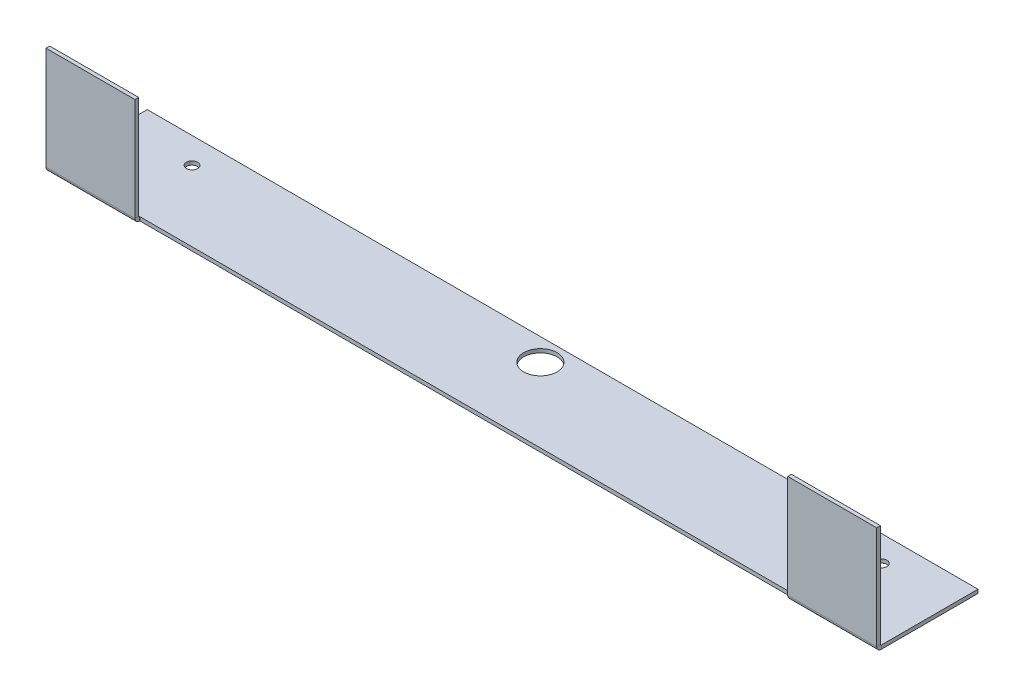
ISO-10303-21;
HEADER;
FILE_DESCRIPTION(('STEP AP214'),'2;1');
FILE_NAME('part.step','',(''),(''),'','','');
FILE_SCHEMA(('AUTOMOTIVE_DESIGN { 1 0 10303 214 1 1 1 1 }'));
ENDSEC;
DATA;
#1=APPLICATION_CONTEXT('core data for automotive mechanical design processes');
#2=APPLICATION_PROTOCOL_DEFINITION('international standard','automotive_design',2000,#1);
#3=PRODUCT_CONTEXT('',#1,'mechanical');
#4=PRODUCT('Part','Part','',(#3));
#5=PRODUCT_RELATED_PRODUCT_CATEGORY('part','',(#4));
#6=PRODUCT_DEFINITION_FORMATION('','',#4);
#7=PRODUCT_DEFINITION_CONTEXT('part definition',#1,'design');
#8=PRODUCT_DEFINITION('design','',#6,#7);
#9=PRODUCT_DEFINITION_SHAPE('','',#8);
#10=(LENGTH_UNIT() NAMED_UNIT(*) SI_UNIT(.MILLI.,.METRE.));
#11=(NAMED_UNIT(*) PLANE_ANGLE_UNIT() SI_UNIT($,.RADIAN.));
#12=(NAMED_UNIT(*) SI_UNIT($,.STERADIAN.) SOLID_ANGLE_UNIT());
#13=UNCERTAINTY_MEASURE_WITH_UNIT(LENGTH_MEASURE(1.E-05),#10,'distance_accuracy_value','');
#14=(GEOMETRIC_REPRESENTATION_CONTEXT(3) GLOBAL_UNCERTAINTY_ASSIGNED_CONTEXT((#13)) GLOBAL_UNIT_ASSIGNED_CONTEXT((#10,
#11,#12)) REPRESENTATION_CONTEXT('',''));
#15=CARTESIAN_POINT('',(0.,0.,0.));
#16=DIRECTION('',(0.,0.,1.));
#17=DIRECTION('',(1.,0.,0.));
#18=AXIS2_PLACEMENT_3D('',#15,#16,#17);
#19=CARTESIAN_POINT('',(-106.274614161748,-4.17251225689531,5.35248774310397));
#20=DIRECTION('',(0.,-1.,0.));
#21=DIRECTION('',(0.,0.,-1.));
#22=AXIS2_PLACEMENT_3D('',#19,#20,#21);
#23=PLANE('',#22);
#24=CARTESIAN_POINT('',(-45.7489541617481,-4.17251225689547,27.5774877431035));
#25=DIRECTION('',(0.,-1.,0.));
#26=DIRECTION('',(0.,0.,-1.));
#27=AXIS2_PLACEMENT_3D('',#24,#25,#26);
#28=CIRCLE('',#27,4.76250000000001);
#29=CARTESIAN_POINT('',(-45.7489541617481,-4.17251225689543,22.8149877431035));
#30=VERTEX_POINT('',#29);
#31=EDGE_CURVE('E222',#30,#30,#28,.T.);
#32=ORIENTED_EDGE('',*,*,#31,.F.);
#33=EDGE_LOOP('',(#32));
#34=FACE_BOUND('',#33,.T.);
#35=CARTESIAN_POINT('',(544.399725838252,-4.17251225689545,27.5774877431036));
#36=DIRECTION('',(0.,-1.,0.));
#37=DIRECTION('',(0.,0.,-1.));
#38=AXIS2_PLACEMENT_3D('',#35,#36,#37);
#39=CIRCLE('',#38,4.76250000000001);
#40=CARTESIAN_POINT('',(544.399725838252,-4.17251225689541,22.8149877431036));
#41=VERTEX_POINT('',#40);
#42=EDGE_CURVE('E212',#41,#41,#39,.T.);
#43=ORIENTED_EDGE('',*,*,#42,.F.);
#44=EDGE_LOOP('',(#43));
#45=FACE_BOUND('',#44,.T.);
#46=CARTESIAN_POINT('',(249.325385838252,-4.17251225689543,24.4024877431035));
#47=DIRECTION('',(0.,-1.,0.));
#48=DIRECTION('',(0.,0.,-1.));
#49=AXIS2_PLACEMENT_3D('',#46,#47,#48);
#50=CIRCLE('',#49,14.2875);
#51=CARTESIAN_POINT('',(249.325385838252,-4.17251225689534,10.1149877431035));
#52=VERTEX_POINT('',#51);
#53=EDGE_CURVE('E209',#52,#52,#50,.T.);
#54=ORIENTED_EDGE('',*,*,#53,.F.);
#55=EDGE_LOOP('',(#54));
#56=FACE_BOUND('',#55,.T.);
#57=DIRECTION('',(0.,0.,-1.));
#58=VECTOR('',#57,1.);
#59=CARTESIAN_POINT('',(-30.0746141617481,-4.17251225689654,179.977487743104));
#60=LINE('',#59,#58);
#61=CARTESIAN_POINT('',(-30.0746141617481,-4.17251225689589,88.1634));
#62=VERTEX_POINT('',#61);
#63=CARTESIAN_POINT('',(-30.0746141617481,-4.1725122568959,87.902487743104));
#64=VERTEX_POINT('',#63);
#65=EDGE_CURVE('E182',#62,#64,#60,.T.);
#66=ORIENTED_EDGE('',*,*,#65,.F.);
#67=DIRECTION('',(-1.,0.,0.));
#68=VECTOR('',#67,1.);
#69=CARTESIAN_POINT('',(-106.274614161748,-4.1725122568959,88.1634));
#70=LINE('',#69,#68);
#71=CARTESIAN_POINT('',(-106.274614161748,-4.1725122568959,88.1634));
#72=VERTEX_POINT('',#71);
#73=EDGE_CURVE('E162',#62,#72,#70,.T.);
#74=ORIENTED_EDGE('',*,*,#73,.T.);
#75=DIRECTION('',(0.,0.,1.));
#76=VECTOR('',#75,1.);
#77=CARTESIAN_POINT('',(-106.274614161748,-4.17251225689531,5.35248774310397));
#78=LINE('',#77,#76);
#79=CARTESIAN_POINT('',(-106.274614161748,-4.17251225689531,5.35248774310397));
#80=VERTEX_POINT('',#79);
#81=EDGE_CURVE('E197',#80,#72,#78,.T.);
#82=ORIENTED_EDGE('',*,*,#81,.F.);
#83=DIRECTION('',(1.,0.,0.));
#84=VECTOR('',#83,1.);
#85=CARTESIAN_POINT('',(-106.274614161748,-4.17251225689531,5.35248774310397));
#86=LINE('',#85,#84);
#87=CARTESIAN_POINT('',(604.925385838252,-4.1725122568953,5.35248774310396));
#88=VERTEX_POINT('',#87);
#89=EDGE_CURVE('E314',#80,#88,#86,.T.);
#90=ORIENTED_EDGE('',*,*,#89,.T.);
#91=DIRECTION('',(0.,0.,1.));
#92=VECTOR('',#91,1.);
#93=CARTESIAN_POINT('',(604.925385838252,-4.1725122568953,5.35248774310396));
#94=LINE('',#93,#92);
#95=CARTESIAN_POINT('',(604.925385838252,-4.17251225689588,88.1633999999999));
#96=VERTEX_POINT('',#95);
#97=EDGE_CURVE('E199',#88,#96,#94,.T.);
#98=ORIENTED_EDGE('',*,*,#97,.T.);
#99=DIRECTION('',(1.,0.,0.));
#100=VECTOR('',#99,1.);
#101=CARTESIAN_POINT('',(-106.274614161748,-4.1725122568959,88.1633999999999));
#102=LINE('',#101,#100);
#103=CARTESIAN_POINT('',(528.725385838252,-4.17251225689588,88.1633999999999));
#104=VERTEX_POINT('',#103);
#105=EDGE_CURVE('E319',#104,#96,#102,.T.);
#106=ORIENTED_EDGE('',*,*,#105,.F.);
#107=DIRECTION('',(0.,0.,1.));
#108=VECTOR('',#107,1.);
#109=CARTESIAN_POINT('',(528.725385838252,-4.17251225689652,179.977487743104));
#110=LINE('',#109,#108);
#111=CARTESIAN_POINT('',(528.725385838252,-4.17251225689588,87.9024877431039));
#112=VERTEX_POINT('',#111);
#113=EDGE_CURVE('E309',#112,#104,#110,.T.);
#114=ORIENTED_EDGE('',*,*,#113,.F.);
#115=DIRECTION('',(-1.,0.,0.));
#116=VECTOR('',#115,1.);
#117=CARTESIAN_POINT('',(528.725385838252,-4.17251225689588,87.9024877431039));
#118=LINE('',#117,#116);
#119=EDGE_CURVE('E184',#112,#64,#118,.T.);
#120=ORIENTED_EDGE('',*,*,#119,.T.);
#121=EDGE_LOOP('',(#66,#74,#82,#90,#98,#106,#114,#120));
#122=FACE_BOUND('',#121,.T.);
#123=ADVANCED_FACE('F47',(#34,#45,#56,#122),#23,.T.);
#124=CARTESIAN_POINT('',(-106.274614161748,-0.997512256895317,5.35248774310398));
#125=DIRECTION('',(-1.,0.,0.));
#126=DIRECTION('',(0.,0.,-1.));
#127=AXIS2_PLACEMENT_3D('',#124,#125,#126);
#128=PLANE('',#127);
#129=ORIENTED_EDGE('',*,*,#81,.T.);
#130=DIRECTION('',(0.,1.,0.));
#131=VECTOR('',#130,1.);
#132=CARTESIAN_POINT('',(-106.274614161748,-0.997512256895608,88.1634));
#133=LINE('',#132,#131);
#134=CARTESIAN_POINT('',(-106.274614161748,-0.997512256895895,88.1634));
#135=VERTEX_POINT('',#134);
#136=EDGE_CURVE('E12',#72,#135,#133,.T.);
#137=ORIENTED_EDGE('',*,*,#136,.T.);
#138=DIRECTION('',(0.,0.,1.));
#139=VECTOR('',#138,1.);
#140=CARTESIAN_POINT('',(-106.274614161748,-0.997512256895317,5.35248774310398));
#141=LINE('',#140,#139);
#142=CARTESIAN_POINT('',(-106.274614161748,-0.997512256895317,5.35248774310398));
#143=VERTEX_POINT('',#142);
#144=EDGE_CURVE('E200',#143,#135,#141,.T.);
#145=ORIENTED_EDGE('',*,*,#144,.F.);
#146=DIRECTION('',(0.,-1.,0.));
#147=VECTOR('',#146,1.);
#148=CARTESIAN_POINT('',(-106.274614161748,-0.997512256895317,5.35248774310398));
#149=LINE('',#148,#147);
#150=EDGE_CURVE('E203',#143,#80,#149,.T.);
#151=ORIENTED_EDGE('',*,*,#150,.T.);
#152=EDGE_LOOP('',(#129,#137,#145,#151));
#153=FACE_BOUND('',#152,.T.);
#154=ADVANCED_FACE('F49',(#153),#128,.T.);
#155=CARTESIAN_POINT('',(-106.274614161748,-0.997512256895317,5.35248774310398));
#156=DIRECTION('',(0.,-1.,0.));
#157=DIRECTION('',(0.,0.,-1.));
#158=AXIS2_PLACEMENT_3D('',#155,#156,#157);
#159=PLANE('',#158);
#160=CARTESIAN_POINT('',(-45.7489541617481,-0.997512256895469,27.5774877431035));
#161=DIRECTION('',(0.,-1.,0.));
#162=DIRECTION('',(0.,0.,-1.));
#163=AXIS2_PLACEMENT_3D('',#160,#161,#162);
#164=CIRCLE('',#163,4.76250000000001);
#165=CARTESIAN_POINT('',(-45.7489541617481,-0.997512256895436,22.8149877431035));
#166=VERTEX_POINT('',#165);
#167=EDGE_CURVE('E51',#166,#166,#164,.T.);
#168=ORIENTED_EDGE('',*,*,#167,.T.);
#169=EDGE_LOOP('',(#168));
#170=FACE_BOUND('',#169,.T.);
#171=CARTESIAN_POINT('',(544.399725838252,-0.997512256895441,27.5774877431036));
#172=DIRECTION('',(0.,-1.,0.));
#173=DIRECTION('',(0.,0.,-1.));
#174=AXIS2_PLACEMENT_3D('',#171,#172,#173);
#175=CIRCLE('',#174,4.76250000000001);
#176=CARTESIAN_POINT('',(544.399725838252,-0.997512256895408,22.8149877431036));
#177=VERTEX_POINT('',#176);
#178=EDGE_CURVE('E210',#177,#177,#175,.T.);
#179=ORIENTED_EDGE('',*,*,#178,.T.);
#180=EDGE_LOOP('',(#179));
#181=FACE_BOUND('',#180,.T.);
#182=CARTESIAN_POINT('',(249.325385838252,-0.997512256895441,24.4024877431035));
#183=DIRECTION('',(0.,-1.,0.));
#184=DIRECTION('',(0.,0.,-1.));
#185=AXIS2_PLACEMENT_3D('',#182,#183,#184);
#186=CIRCLE('',#185,14.2875);
#187=CARTESIAN_POINT('',(249.325385838252,-0.997512256895342,10.1149877431035));
#188=VERTEX_POINT('',#187);
#189=EDGE_CURVE('E206',#188,#188,#186,.T.);
#190=ORIENTED_EDGE('',*,*,#189,.T.);
#191=EDGE_LOOP('',(#190));
#192=FACE_BOUND('',#191,.T.);
#193=DIRECTION('',(-1.,0.,0.));
#194=VECTOR('',#193,1.);
#195=CARTESIAN_POINT('',(-106.274614161748,-0.997512256895899,88.1634));
#196=LINE('',#195,#194);
#197=CARTESIAN_POINT('',(-30.0746141617481,-0.997512256895893,88.1634));
#198=VERTEX_POINT('',#197);
#199=EDGE_CURVE('E56',#198,#135,#196,.T.);
#200=ORIENTED_EDGE('',*,*,#199,.F.);
#201=DIRECTION('',(0.,0.,-1.));
#202=VECTOR('',#201,1.);
#203=CARTESIAN_POINT('',(-30.0746141617481,-0.997512256896538,179.977487743104));
#204=LINE('',#203,#202);
#205=CARTESIAN_POINT('',(-30.0746141617481,-0.997512256895899,87.9024877431041));
#206=VERTEX_POINT('',#205);
#207=EDGE_CURVE('E188',#198,#206,#204,.T.);
#208=ORIENTED_EDGE('',*,*,#207,.T.);
#209=DIRECTION('',(1.,0.,0.));
#210=VECTOR('',#209,1.);
#211=CARTESIAN_POINT('',(-106.274614161748,-0.997512256895899,87.902487743104));
#212=LINE('',#211,#210);
#213=CARTESIAN_POINT('',(528.725385838252,-0.997512256895886,87.902487743104));
#214=VERTEX_POINT('',#213);
#215=EDGE_CURVE('E300',#214,#206,#212,.F.);
#216=ORIENTED_EDGE('',*,*,#215,.F.);
#217=DIRECTION('',(0.,0.,1.));
#218=VECTOR('',#217,1.);
#219=CARTESIAN_POINT('',(528.725385838252,-0.997512256896524,179.977487743104));
#220=LINE('',#219,#218);
#221=CARTESIAN_POINT('',(528.725385838252,-0.997512256895886,88.1633999999999));
#222=VERTEX_POINT('',#221);
#223=EDGE_CURVE('E72',#214,#222,#220,.T.);
#224=ORIENTED_EDGE('',*,*,#223,.T.);
#225=DIRECTION('',(1.,0.,0.));
#226=VECTOR('',#225,1.);
#227=CARTESIAN_POINT('',(-106.274614161748,-0.997512256895899,88.1634));
#228=LINE('',#227,#226);
#229=CARTESIAN_POINT('',(604.925385838252,-0.997512256895886,88.1633999999999));
#230=VERTEX_POINT('',#229);
#231=EDGE_CURVE('E326',#222,#230,#228,.T.);
#232=ORIENTED_EDGE('',*,*,#231,.T.);
#233=DIRECTION('',(0.,0.,1.));
#234=VECTOR('',#233,1.);
#235=CARTESIAN_POINT('',(604.925385838252,-0.997512256895303,5.35248774310397));
#236=LINE('',#235,#234);
#237=CARTESIAN_POINT('',(604.925385838252,-0.997512256895303,5.35248774310397));
#238=VERTEX_POINT('',#237);
#239=EDGE_CURVE('E323',#238,#230,#236,.T.);
#240=ORIENTED_EDGE('',*,*,#239,.F.);
#241=DIRECTION('',(1.,0.,0.));
#242=VECTOR('',#241,1.);
#243=CARTESIAN_POINT('',(-106.274614161748,-0.997512256895317,5.35248774310398));
#244=LINE('',#243,#242);
#245=EDGE_CURVE('E204',#143,#238,#244,.T.);
#246=ORIENTED_EDGE('',*,*,#245,.F.);
#247=ORIENTED_EDGE('',*,*,#144,.T.);
#248=EDGE_LOOP('',(#200,#208,#216,#224,#232,#240,#246,#247));
#249=FACE_BOUND('',#248,.T.);
#250=ADVANCED_FACE('F369',(#170,#181,#192,#249),#159,.F.);
#251=CARTESIAN_POINT('',(528.725385838252,-0.997512256896524,179.977487743104));
#252=DIRECTION('',(1.,0.,0.));
#253=DIRECTION('',(0.,0.,1.));
#254=AXIS2_PLACEMENT_3D('',#251,#252,#253);
#255=PLANE('',#254);
#256=ORIENTED_EDGE('',*,*,#113,.T.);
#257=DIRECTION('',(0.,1.,0.));
#258=VECTOR('',#257,1.);
#259=CARTESIAN_POINT('',(528.725385838252,-0.997512256895872,88.1633999999999));
#260=LINE('',#259,#258);
#261=EDGE_CURVE('E171',#104,#222,#260,.T.);
#262=ORIENTED_EDGE('',*,*,#261,.T.);
#263=ORIENTED_EDGE('',*,*,#223,.F.);
#264=DIRECTION('',(0.,-1.,0.));
#265=VECTOR('',#264,1.);
#266=CARTESIAN_POINT('',(528.725385838252,-4.17251225689588,87.9024877431039));
#267=LINE('',#266,#265);
#268=EDGE_CURVE('E303',#112,#214,#267,.F.);
#269=ORIENTED_EDGE('',*,*,#268,.F.);
#270=EDGE_LOOP('',(#256,#262,#263,#269));
#271=FACE_BOUND('',#270,.T.);
#272=ADVANCED_FACE('F421',(#271),#255,.F.);
#273=CARTESIAN_POINT('',(604.925385838252,-4.1725122568953,5.35248774310396));
#274=DIRECTION('',(1.,0.,0.));
#275=DIRECTION('',(0.,0.,1.));
#276=AXIS2_PLACEMENT_3D('',#273,#274,#275);
#277=PLANE('',#276);
#278=DIRECTION('',(0.,1.,0.));
#279=VECTOR('',#278,1.);
#280=CARTESIAN_POINT('',(604.925385838252,-4.17251225689588,88.1633999999999));
#281=LINE('',#280,#279);
#282=EDGE_CURVE('E322',#96,#230,#281,.T.);
#283=ORIENTED_EDGE('',*,*,#282,.F.);
#284=ORIENTED_EDGE('',*,*,#97,.F.);
#285=DIRECTION('',(0.,1.,0.));
#286=VECTOR('',#285,1.);
#287=CARTESIAN_POINT('',(604.925385838252,-4.1725122568953,5.35248774310396));
#288=LINE('',#287,#286);
#289=EDGE_CURVE('E311',#88,#238,#288,.T.);
#290=ORIENTED_EDGE('',*,*,#289,.T.);
#291=ORIENTED_EDGE('',*,*,#239,.T.);
#292=EDGE_LOOP('',(#283,#284,#290,#291));
#293=FACE_BOUND('',#292,.T.);
#294=ADVANCED_FACE('F372',(#293),#277,.T.);
#295=CARTESIAN_POINT('',(0.,-4.17251225689531,5.35248774310397));
#296=DIRECTION('',(0.,0.,1.));
#297=DIRECTION('',(-1.,0.,0.));
#298=AXIS2_PLACEMENT_3D('',#295,#296,#297);
#299=PLANE('',#298);
#300=ORIENTED_EDGE('',*,*,#245,.T.);
#301=ORIENTED_EDGE('',*,*,#289,.F.);
#302=ORIENTED_EDGE('',*,*,#89,.F.);
#303=ORIENTED_EDGE('',*,*,#150,.F.);
#304=EDGE_LOOP('',(#300,#301,#302,#303));
#305=FACE_BOUND('',#304,.T.);
#306=ADVANCED_FACE('F374',(#305),#299,.F.);
#307=CARTESIAN_POINT('',(-30.0746141617481,-0.997512256896538,179.977487743104));
#308=DIRECTION('',(-1.,0.,0.));
#309=DIRECTION('',(0.,0.,-1.));
#310=AXIS2_PLACEMENT_3D('',#307,#308,#309);
#311=PLANE('',#310);
#312=DIRECTION('',(0.,1.,0.));
#313=VECTOR('',#312,1.);
#314=CARTESIAN_POINT('',(-30.0746141617481,-0.997512256896219,88.1634));
#315=LINE('',#314,#313);
#316=EDGE_CURVE('E170',#62,#198,#315,.T.);
#317=ORIENTED_EDGE('',*,*,#316,.F.);
#318=ORIENTED_EDGE('',*,*,#65,.T.);
#319=DIRECTION('',(0.,-1.,0.));
#320=VECTOR('',#319,1.);
#321=CARTESIAN_POINT('',(-30.0746141617481,-4.1725122568959,87.902487743104));
#322=LINE('',#321,#320);
#323=EDGE_CURVE('E307',#64,#206,#322,.F.);
#324=ORIENTED_EDGE('',*,*,#323,.T.);
#325=ORIENTED_EDGE('',*,*,#207,.F.);
#326=EDGE_LOOP('',(#317,#318,#324,#325));
#327=FACE_BOUND('',#326,.T.);
#328=ADVANCED_FACE('F191',(#327),#311,.F.);
#329=CARTESIAN_POINT('',(528.725385838252,-4.17251225689588,87.9024877431039));
#330=DIRECTION('',(0.,0.,1.));
#331=DIRECTION('',(-1.,0.,0.));
#332=AXIS2_PLACEMENT_3D('',#329,#330,#331);
#333=PLANE('',#332);
#334=ORIENTED_EDGE('',*,*,#323,.F.);
#335=ORIENTED_EDGE('',*,*,#119,.F.);
#336=ORIENTED_EDGE('',*,*,#268,.T.);
#337=ORIENTED_EDGE('',*,*,#215,.T.);
#338=EDGE_LOOP('',(#334,#335,#336,#337));
#339=FACE_BOUND('',#338,.T.);
#340=ADVANCED_FACE('F424',(#339),#333,.T.);
#341=CARTESIAN_POINT('',(0.,87.9024877431041,92.0750000000003));
#342=DIRECTION('',(0.,1.,0.));
#343=DIRECTION('',(-1.,0.,0.));
#344=AXIS2_PLACEMENT_3D('',#341,#342,#343);
#345=PLANE('',#344);
#346=DIRECTION('',(0.,0.,1.));
#347=VECTOR('',#346,1.);
#348=CARTESIAN_POINT('',(528.725385838252,87.9024877431041,88.9000000000003));
#349=LINE('',#348,#347);
#350=CARTESIAN_POINT('',(528.725385838252,87.9024877431041,88.9000000000003));
#351=VERTEX_POINT('',#350);
#352=CARTESIAN_POINT('',(528.725385838252,87.9024877431041,92.0750000000003));
#353=VERTEX_POINT('',#352);
#354=EDGE_CURVE('E294',#351,#353,#349,.T.);
#355=ORIENTED_EDGE('',*,*,#354,.T.);
#356=DIRECTION('',(1.,0.,0.));
#357=VECTOR('',#356,1.);
#358=CARTESIAN_POINT('',(-106.274614161748,87.9024877431041,92.0750000000003));
#359=LINE('',#358,#357);
#360=CARTESIAN_POINT('',(604.925385838252,87.9024877431041,92.0750000000003));
#361=VERTEX_POINT('',#360);
#362=EDGE_CURVE('E291',#353,#361,#359,.T.);
#363=ORIENTED_EDGE('',*,*,#362,.T.);
#364=DIRECTION('',(0.,0.,-1.));
#365=VECTOR('',#364,1.);
#366=CARTESIAN_POINT('',(604.925385838252,87.9024877431041,92.0750000000003));
#367=LINE('',#366,#365);
#368=CARTESIAN_POINT('',(604.925385838252,87.9024877431041,88.9000000000002));
#369=VERTEX_POINT('',#368);
#370=EDGE_CURVE('E288',#361,#369,#367,.T.);
#371=ORIENTED_EDGE('',*,*,#370,.T.);
#372=DIRECTION('',(1.,0.,0.));
#373=VECTOR('',#372,1.);
#374=CARTESIAN_POINT('',(-106.274614161748,87.9024877431041,88.9000000000003));
#375=LINE('',#374,#373);
#376=EDGE_CURVE('E273',#351,#369,#375,.T.);
#377=ORIENTED_EDGE('',*,*,#376,.F.);
#378=EDGE_LOOP('',(#355,#363,#371,#377));
#379=FACE_BOUND('',#378,.T.);
#380=ADVANCED_FACE('F353',(#379),#345,.T.);
#381=CARTESIAN_POINT('',(-106.274614161748,-86.7225122568959,92.0749999999997));
#382=DIRECTION('',(0.,0.,1.));
#383=DIRECTION('',(0.,-1.,0.));
#384=AXIS2_PLACEMENT_3D('',#381,#382,#383);
#385=PLANE('',#384);
#386=DIRECTION('',(0.,1.,0.));
#387=VECTOR('',#386,1.);
#388=CARTESIAN_POINT('',(528.725385838252,87.9024877431041,92.0750000000003));
#389=LINE('',#388,#387);
#390=CARTESIAN_POINT('',(528.725385838252,-0.260912256895895,92.0749999999999));
#391=VERTEX_POINT('',#390);
#392=EDGE_CURVE('E271',#391,#353,#389,.T.);
#393=ORIENTED_EDGE('',*,*,#392,.F.);
#394=DIRECTION('',(1.,0.,0.));
#395=VECTOR('',#394,1.);
#396=CARTESIAN_POINT('',(-106.274614161748,-0.260912256895909,92.075));
#397=LINE('',#396,#395);
#398=CARTESIAN_POINT('',(604.925385838252,-0.260912256895895,92.0749999999999));
#399=VERTEX_POINT('',#398);
#400=EDGE_CURVE('E285',#391,#399,#397,.T.);
#401=ORIENTED_EDGE('',*,*,#400,.T.);
#402=DIRECTION('',(0.,1.,0.));
#403=VECTOR('',#402,1.);
#404=CARTESIAN_POINT('',(604.925385838252,-86.7225122568959,92.0749999999996));
#405=LINE('',#404,#403);
#406=EDGE_CURVE('E283',#399,#361,#405,.T.);
#407=ORIENTED_EDGE('',*,*,#406,.T.);
#408=ORIENTED_EDGE('',*,*,#362,.F.);
#409=EDGE_LOOP('',(#393,#401,#407,#408));
#410=FACE_BOUND('',#409,.T.);
#411=ADVANCED_FACE('F351',(#410),#385,.T.);
#412=CARTESIAN_POINT('',(604.925385838252,-86.7225122568959,92.0749999999996));
#413=DIRECTION('',(1.,0.,0.));
#414=DIRECTION('',(0.,1.,0.));
#415=AXIS2_PLACEMENT_3D('',#412,#413,#414);
#416=PLANE('',#415);
#417=ORIENTED_EDGE('',*,*,#406,.F.);
#418=DIRECTION('',(0.,0.,-1.));
#419=VECTOR('',#418,1.);
#420=CARTESIAN_POINT('',(604.925385838252,-0.260912256895895,92.0749999999999));
#421=LINE('',#420,#419);
#422=CARTESIAN_POINT('',(604.925385838252,-0.260912256895882,88.8999999999999));
#423=VERTEX_POINT('',#422);
#424=EDGE_CURVE('E280',#399,#423,#421,.T.);
#425=ORIENTED_EDGE('',*,*,#424,.T.);
#426=DIRECTION('',(0.,1.,0.));
#427=VECTOR('',#426,1.);
#428=CARTESIAN_POINT('',(604.925385838252,-86.7225122568959,88.8999999999996));
#429=LINE('',#428,#427);
#430=EDGE_CURVE('E278',#423,#369,#429,.T.);
#431=ORIENTED_EDGE('',*,*,#430,.T.);
#432=ORIENTED_EDGE('',*,*,#370,.F.);
#433=EDGE_LOOP('',(#417,#425,#431,#432));
#434=FACE_BOUND('',#433,.T.);
#435=ADVANCED_FACE('F346',(#434),#416,.T.);
#436=CARTESIAN_POINT('',(-106.274614161748,-86.7225122568959,88.8999999999997));
#437=DIRECTION('',(0.,0.,1.));
#438=DIRECTION('',(0.,-1.,0.));
#439=AXIS2_PLACEMENT_3D('',#436,#437,#438);
#440=PLANE('',#439);
#441=DIRECTION('',(1.,0.,0.));
#442=VECTOR('',#441,1.);
#443=CARTESIAN_POINT('',(-106.274614161748,-0.260912256895895,88.9));
#444=LINE('',#443,#442);
#445=CARTESIAN_POINT('',(528.725385838252,-0.260912256895882,88.8999999999999));
#446=VERTEX_POINT('',#445);
#447=EDGE_CURVE('E297',#446,#423,#444,.T.);
#448=ORIENTED_EDGE('',*,*,#447,.F.);
#449=DIRECTION('',(0.,1.,0.));
#450=VECTOR('',#449,1.);
#451=CARTESIAN_POINT('',(528.725385838252,87.9024877431041,88.9000000000003));
#452=LINE('',#451,#450);
#453=EDGE_CURVE('E276',#446,#351,#452,.T.);
#454=ORIENTED_EDGE('',*,*,#453,.T.);
#455=ORIENTED_EDGE('',*,*,#376,.T.);
#456=ORIENTED_EDGE('',*,*,#430,.F.);
#457=EDGE_LOOP('',(#448,#454,#455,#456));
#458=FACE_BOUND('',#457,.T.);
#459=ADVANCED_FACE('F613',(#458),#440,.F.);
#460=CARTESIAN_POINT('',(528.725385838252,87.9024877431041,88.9000000000003));
#461=DIRECTION('',(1.,0.,0.));
#462=DIRECTION('',(0.,1.,0.));
#463=AXIS2_PLACEMENT_3D('',#460,#461,#462);
#464=PLANE('',#463);
#465=DIRECTION('',(0.,0.,-1.));
#466=VECTOR('',#465,1.);
#467=CARTESIAN_POINT('',(528.725385838252,-0.260912256895882,88.8999999999999));
#468=LINE('',#467,#466);
#469=EDGE_CURVE('E266',#391,#446,#468,.T.);
#470=ORIENTED_EDGE('',*,*,#469,.F.);
#471=ORIENTED_EDGE('',*,*,#392,.T.);
#472=ORIENTED_EDGE('',*,*,#354,.F.);
#473=ORIENTED_EDGE('',*,*,#453,.F.);
#474=EDGE_LOOP('',(#470,#471,#472,#473));
#475=FACE_BOUND('',#474,.T.);
#476=ADVANCED_FACE('F359',(#475),#464,.F.);
#477=CARTESIAN_POINT('',(528.725385838252,-0.260912256895882,88.1634));
#478=DIRECTION('',(-1.,0.,0.));
#479=DIRECTION('',(0.,-1.,0.));
#480=AXIS2_PLACEMENT_3D('',#477,#478,#479);
#481=PLANE('',#480);
#482=ORIENTED_EDGE('',*,*,#469,.T.);
#483=CARTESIAN_POINT('',(528.725385838252,-0.260912256895882,88.1634));
#484=DIRECTION('',(1.,0.,0.));
#485=DIRECTION('',(0.,1.,0.));
#486=AXIS2_PLACEMENT_3D('',#483,#484,#485);
#487=CIRCLE('',#486,0.7366);
#488=EDGE_CURVE('E232',#446,#222,#487,.T.);
#489=ORIENTED_EDGE('',*,*,#488,.T.);
#490=ORIENTED_EDGE('',*,*,#261,.F.);
#491=CARTESIAN_POINT('',(528.725385838252,-0.260912256895882,88.1634));
#492=DIRECTION('',(1.,0.,0.));
#493=DIRECTION('',(0.,-1.,0.));
#494=AXIS2_PLACEMENT_3D('',#491,#492,#493);
#495=CIRCLE('',#494,3.9116);
#496=EDGE_CURVE('E259',#391,#104,#495,.T.);
#497=ORIENTED_EDGE('',*,*,#496,.F.);
#498=EDGE_LOOP('',(#482,#489,#490,#497));
#499=FACE_BOUND('',#498,.T.);
#500=ADVANCED_FACE('F363',(#499),#481,.T.);
#501=CARTESIAN_POINT('',(604.925385838252,-0.260912256895882,88.1633999999999));
#502=DIRECTION('',(1.,0.,0.));
#503=DIRECTION('',(0.,1.,0.));
#504=AXIS2_PLACEMENT_3D('',#501,#502,#503);
#505=PLANE('',#504);
#506=ORIENTED_EDGE('',*,*,#282,.T.);
#507=CARTESIAN_POINT('',(604.925385838252,-0.260912256895882,88.1633999999999));
#508=DIRECTION('',(1.,0.,0.));
#509=DIRECTION('',(0.,1.,0.));
#510=AXIS2_PLACEMENT_3D('',#507,#508,#509);
#511=CIRCLE('',#510,0.7366);
#512=EDGE_CURVE('E263',#230,#423,#511,.F.);
#513=ORIENTED_EDGE('',*,*,#512,.T.);
#514=ORIENTED_EDGE('',*,*,#424,.F.);
#515=CARTESIAN_POINT('',(604.925385838252,-0.260912256895882,88.1633999999999));
#516=DIRECTION('',(-1.,0.,0.));
#517=DIRECTION('',(0.,-1.,0.));
#518=AXIS2_PLACEMENT_3D('',#515,#516,#517);
#519=CIRCLE('',#518,3.9116);
#520=EDGE_CURVE('E262',#96,#399,#519,.T.);
#521=ORIENTED_EDGE('',*,*,#520,.F.);
#522=EDGE_LOOP('',(#506,#513,#514,#521));
#523=FACE_BOUND('',#522,.T.);
#524=ADVANCED_FACE('F341',(#523),#505,.T.);
#525=CARTESIAN_POINT('',(490.471943571399,-0.260912256895882,88.1634));
#526=DIRECTION('',(1.,0.,0.));
#527=DIRECTION('',(0.,1.,0.));
#528=AXIS2_PLACEMENT_3D('',#525,#526,#527);
#529=CYLINDRICAL_SURFACE('',#528,3.9116);
#530=ORIENTED_EDGE('',*,*,#520,.T.);
#531=ORIENTED_EDGE('',*,*,#400,.F.);
#532=ORIENTED_EDGE('',*,*,#496,.T.);
#533=ORIENTED_EDGE('',*,*,#105,.T.);
#534=EDGE_LOOP('',(#530,#531,#532,#533));
#535=FACE_BOUND('',#534,.T.);
#536=ADVANCED_FACE('F338',(#535),#529,.T.);
#537=CARTESIAN_POINT('',(490.471943571399,-0.260912256895882,88.1634));
#538=DIRECTION('',(1.,0.,0.));
#539=DIRECTION('',(0.,1.,0.));
#540=AXIS2_PLACEMENT_3D('',#537,#538,#539);
#541=CYLINDRICAL_SURFACE('',#540,0.7366);
#542=ORIENTED_EDGE('',*,*,#512,.F.);
#543=ORIENTED_EDGE('',*,*,#231,.F.);
#544=ORIENTED_EDGE('',*,*,#488,.F.);
#545=ORIENTED_EDGE('',*,*,#447,.T.);
#546=EDGE_LOOP('',(#542,#543,#544,#545));
#547=FACE_BOUND('',#546,.T.);
#548=ADVANCED_FACE('F367',(#547),#541,.F.);
#549=CARTESIAN_POINT('',(0.,87.902487743104,92.0750000000003));
#550=DIRECTION('',(0.,1.,0.));
#551=DIRECTION('',(-1.,0.,0.));
#552=AXIS2_PLACEMENT_3D('',#549,#550,#551);
#553=PLANE('',#552);
#554=DIRECTION('',(0.,0.,1.));
#555=VECTOR('',#554,1.);
#556=CARTESIAN_POINT('',(-30.0746141617481,87.902487743104,88.9000000000003));
#557=LINE('',#556,#555);
#558=CARTESIAN_POINT('',(-30.0746141617481,87.902487743104,88.9000000000003));
#559=VERTEX_POINT('',#558);
#560=CARTESIAN_POINT('',(-30.0746141617481,87.902487743104,92.0750000000003));
#561=VERTEX_POINT('',#560);
#562=EDGE_CURVE('E244',#559,#561,#557,.T.);
#563=ORIENTED_EDGE('',*,*,#562,.F.);
#564=DIRECTION('',(1.,0.,0.));
#565=VECTOR('',#564,1.);
#566=CARTESIAN_POINT('',(-106.274614161748,87.902487743104,88.9000000000003));
#567=LINE('',#566,#565);
#568=CARTESIAN_POINT('',(-106.274614161748,87.902487743104,88.9000000000003));
#569=VERTEX_POINT('',#568);
#570=EDGE_CURVE('E233',#569,#559,#567,.T.);
#571=ORIENTED_EDGE('',*,*,#570,.F.);
#572=DIRECTION('',(0.,0.,1.));
#573=VECTOR('',#572,1.);
#574=CARTESIAN_POINT('',(-106.274614161748,87.902487743104,88.9000000000003));
#575=LINE('',#574,#573);
#576=CARTESIAN_POINT('',(-106.274614161748,87.902487743104,92.0750000000003));
#577=VERTEX_POINT('',#576);
#578=EDGE_CURVE('E253',#569,#577,#575,.T.);
#579=ORIENTED_EDGE('',*,*,#578,.T.);
#580=DIRECTION('',(1.,0.,0.));
#581=VECTOR('',#580,1.);
#582=CARTESIAN_POINT('',(-106.274614161748,87.902487743104,92.0750000000003));
#583=LINE('',#582,#581);
#584=EDGE_CURVE('E250',#577,#561,#583,.T.);
#585=ORIENTED_EDGE('',*,*,#584,.T.);
#586=EDGE_LOOP('',(#563,#571,#579,#585));
#587=FACE_BOUND('',#586,.T.);
#588=ADVANCED_FACE('F399',(#587),#553,.T.);
#589=CARTESIAN_POINT('',(-106.274614161748,-86.722512256896,92.0749999999997));
#590=DIRECTION('',(0.,0.,1.));
#591=DIRECTION('',(0.,-1.,0.));
#592=AXIS2_PLACEMENT_3D('',#589,#590,#591);
#593=PLANE('',#592);
#594=DIRECTION('',(-1.,0.,0.));
#595=VECTOR('',#594,1.);
#596=CARTESIAN_POINT('',(-106.274614161748,-0.260912256895909,92.075));
#597=LINE('',#596,#595);
#598=CARTESIAN_POINT('',(-30.0746141617481,-0.260912256895906,92.075));
#599=VERTEX_POINT('',#598);
#600=CARTESIAN_POINT('',(-106.274614161748,-0.260912256895908,92.075));
#601=VERTEX_POINT('',#600);
#602=EDGE_CURVE('E226',#599,#601,#597,.T.);
#603=ORIENTED_EDGE('',*,*,#602,.F.);
#604=DIRECTION('',(0.,-1.,0.));
#605=VECTOR('',#604,1.);
#606=CARTESIAN_POINT('',(-30.0746141617481,87.902487743104,92.0750000000003));
#607=LINE('',#606,#605);
#608=EDGE_CURVE('E247',#561,#599,#607,.T.);
#609=ORIENTED_EDGE('',*,*,#608,.F.);
#610=ORIENTED_EDGE('',*,*,#584,.F.);
#611=DIRECTION('',(0.,1.,0.));
#612=VECTOR('',#611,1.);
#613=CARTESIAN_POINT('',(-106.274614161748,-86.722512256896,92.0749999999997));
#614=LINE('',#613,#612);
#615=EDGE_CURVE('E230',#601,#577,#614,.T.);
#616=ORIENTED_EDGE('',*,*,#615,.F.);
#617=EDGE_LOOP('',(#603,#609,#610,#616));
#618=FACE_BOUND('',#617,.T.);
#619=ADVANCED_FACE('F397',(#618),#593,.T.);
#620=CARTESIAN_POINT('',(-30.0746141617481,87.902487743104,88.9000000000003));
#621=DIRECTION('',(-1.,0.,0.));
#622=DIRECTION('',(0.,-1.,0.));
#623=AXIS2_PLACEMENT_3D('',#620,#621,#622);
#624=PLANE('',#623);
#625=ORIENTED_EDGE('',*,*,#608,.T.);
#626=DIRECTION('',(0.,0.,-1.));
#627=VECTOR('',#626,1.);
#628=CARTESIAN_POINT('',(-30.0746141617481,-0.260912256895909,88.9000000000003));
#629=LINE('',#628,#627);
#630=CARTESIAN_POINT('',(-30.0746141617481,-0.260912256895909,88.9));
#631=VERTEX_POINT('',#630);
#632=EDGE_CURVE('E178',#599,#631,#629,.T.);
#633=ORIENTED_EDGE('',*,*,#632,.T.);
#634=DIRECTION('',(0.,-1.,0.));
#635=VECTOR('',#634,1.);
#636=CARTESIAN_POINT('',(-30.0746141617481,87.902487743104,88.9000000000003));
#637=LINE('',#636,#635);
#638=EDGE_CURVE('E241',#559,#631,#637,.T.);
#639=ORIENTED_EDGE('',*,*,#638,.F.);
#640=ORIENTED_EDGE('',*,*,#562,.T.);
#641=EDGE_LOOP('',(#625,#633,#639,#640));
#642=FACE_BOUND('',#641,.T.);
#643=ADVANCED_FACE('F394',(#642),#624,.F.);
#644=CARTESIAN_POINT('',(-106.274614161748,-86.722512256896,88.8999999999997));
#645=DIRECTION('',(0.,0.,1.));
#646=DIRECTION('',(0.,-1.,0.));
#647=AXIS2_PLACEMENT_3D('',#644,#645,#646);
#648=PLANE('',#647);
#649=ORIENTED_EDGE('',*,*,#638,.T.);
#650=DIRECTION('',(-1.,0.,0.));
#651=VECTOR('',#650,1.);
#652=CARTESIAN_POINT('',(-106.274614161748,-0.260912256895909,88.9));
#653=LINE('',#652,#651);
#654=CARTESIAN_POINT('',(-106.274614161748,-0.260912256895898,88.9));
#655=VERTEX_POINT('',#654);
#656=EDGE_CURVE('E238',#631,#655,#653,.T.);
#657=ORIENTED_EDGE('',*,*,#656,.T.);
#658=DIRECTION('',(0.,1.,0.));
#659=VECTOR('',#658,1.);
#660=CARTESIAN_POINT('',(-106.274614161748,-86.722512256896,88.8999999999997));
#661=LINE('',#660,#659);
#662=EDGE_CURVE('E236',#655,#569,#661,.T.);
#663=ORIENTED_EDGE('',*,*,#662,.T.);
#664=ORIENTED_EDGE('',*,*,#570,.T.);
#665=EDGE_LOOP('',(#649,#657,#663,#664));
#666=FACE_BOUND('',#665,.T.);
#667=ADVANCED_FACE('F391',(#666),#648,.F.);
#668=CARTESIAN_POINT('',(-106.274614161748,-86.722512256896,88.8999999999997));
#669=DIRECTION('',(-1.,0.,0.));
#670=DIRECTION('',(0.,-1.,0.));
#671=AXIS2_PLACEMENT_3D('',#668,#669,#670);
#672=PLANE('',#671);
#673=DIRECTION('',(0.,0.,-1.));
#674=VECTOR('',#673,1.);
#675=CARTESIAN_POINT('',(-106.274614161748,-0.260912256895909,88.8999999999997));
#676=LINE('',#675,#674);
#677=EDGE_CURVE('E256',#601,#655,#676,.T.);
#678=ORIENTED_EDGE('',*,*,#677,.F.);
#679=ORIENTED_EDGE('',*,*,#615,.T.);
#680=ORIENTED_EDGE('',*,*,#578,.F.);
#681=ORIENTED_EDGE('',*,*,#662,.F.);
#682=EDGE_LOOP('',(#678,#679,#680,#681));
#683=FACE_BOUND('',#682,.T.);
#684=ADVANCED_FACE('F386',(#683),#672,.T.);
#685=CARTESIAN_POINT('',(-30.0746141617481,-0.260912256895893,88.1634));
#686=DIRECTION('',(1.,0.,0.));
#687=DIRECTION('',(0.,0.,-1.));
#688=AXIS2_PLACEMENT_3D('',#685,#686,#687);
#689=PLANE('',#688);
#690=ORIENTED_EDGE('',*,*,#316,.T.);
#691=CARTESIAN_POINT('',(-30.0746141617481,-0.260912256895893,88.1634));
#692=DIRECTION('',(1.,0.,0.));
#693=DIRECTION('',(0.,1.,0.));
#694=AXIS2_PLACEMENT_3D('',#691,#692,#693);
#695=CIRCLE('',#694,0.7366);
#696=EDGE_CURVE('E208',#198,#631,#695,.F.);
#697=ORIENTED_EDGE('',*,*,#696,.T.);
#698=ORIENTED_EDGE('',*,*,#632,.F.);
#699=CARTESIAN_POINT('',(-30.0746141617481,-0.260912256895893,88.1634));
#700=DIRECTION('',(-1.,0.,0.));
#701=DIRECTION('',(0.,0.,-1.));
#702=AXIS2_PLACEMENT_3D('',#699,#700,#701);
#703=CIRCLE('',#702,3.9116);
#704=EDGE_CURVE('E165',#62,#599,#703,.T.);
#705=ORIENTED_EDGE('',*,*,#704,.F.);
#706=EDGE_LOOP('',(#690,#697,#698,#705));
#707=FACE_BOUND('',#706,.T.);
#708=ADVANCED_FACE('F174',(#707),#689,.T.);
#709=CARTESIAN_POINT('',(-106.274614161748,-0.260912256895896,88.1634));
#710=DIRECTION('',(-1.,0.,0.));
#711=DIRECTION('',(0.,0.,1.));
#712=AXIS2_PLACEMENT_3D('',#709,#710,#711);
#713=PLANE('',#712);
#714=CARTESIAN_POINT('',(-106.274614161748,-0.260912256895896,88.1634));
#715=DIRECTION('',(1.,0.,0.));
#716=DIRECTION('',(0.,1.,0.));
#717=AXIS2_PLACEMENT_3D('',#714,#715,#716);
#718=CIRCLE('',#717,0.7366);
#719=EDGE_CURVE('E179',#655,#135,#718,.T.);
#720=ORIENTED_EDGE('',*,*,#719,.T.);
#721=ORIENTED_EDGE('',*,*,#136,.F.);
#722=CARTESIAN_POINT('',(-106.274614161748,-0.260912256895896,88.1634));
#723=DIRECTION('',(1.,0.,0.));
#724=DIRECTION('',(0.,0.,1.));
#725=AXIS2_PLACEMENT_3D('',#722,#723,#724);
#726=CIRCLE('',#725,3.9116);
#727=EDGE_CURVE('E64',#601,#72,#726,.T.);
#728=ORIENTED_EDGE('',*,*,#727,.F.);
#729=ORIENTED_EDGE('',*,*,#677,.T.);
#730=EDGE_LOOP('',(#720,#721,#728,#729));
#731=FACE_BOUND('',#730,.T.);
#732=ADVANCED_FACE('F382',(#731),#713,.T.);
#733=CARTESIAN_POINT('',(-144.528056428601,-0.260912256895897,88.1634));
#734=DIRECTION('',(1.,0.,0.));
#735=DIRECTION('',(0.,1.,0.));
#736=AXIS2_PLACEMENT_3D('',#733,#734,#735);
#737=CYLINDRICAL_SURFACE('',#736,3.9116);
#738=ORIENTED_EDGE('',*,*,#602,.T.);
#739=ORIENTED_EDGE('',*,*,#727,.T.);
#740=ORIENTED_EDGE('',*,*,#73,.F.);
#741=ORIENTED_EDGE('',*,*,#704,.T.);
#742=EDGE_LOOP('',(#738,#739,#740,#741));
#743=FACE_BOUND('',#742,.T.);
#744=ADVANCED_FACE('F164',(#743),#737,.T.);
#745=CARTESIAN_POINT('',(-144.528056428601,-0.260912256895897,88.1634));
#746=DIRECTION('',(1.,0.,0.));
#747=DIRECTION('',(0.,1.,0.));
#748=AXIS2_PLACEMENT_3D('',#745,#746,#747);
#749=CYLINDRICAL_SURFACE('',#748,0.7366);
#750=ORIENTED_EDGE('',*,*,#656,.F.);
#751=ORIENTED_EDGE('',*,*,#696,.F.);
#752=ORIENTED_EDGE('',*,*,#199,.T.);
#753=ORIENTED_EDGE('',*,*,#719,.F.);
#754=EDGE_LOOP('',(#750,#751,#752,#753));
#755=FACE_BOUND('',#754,.T.);
#756=ADVANCED_FACE('F379',(#755),#749,.F.);
#757=CARTESIAN_POINT('',(249.325385838252,87.9024877431046,24.4024877431041));
#758=DIRECTION('',(0.,-1.,0.));
#759=DIRECTION('',(0.,0.,-1.));
#760=AXIS2_PLACEMENT_3D('',#757,#758,#759);
#761=CYLINDRICAL_SURFACE('',#760,14.2875);
#762=ORIENTED_EDGE('',*,*,#53,.T.);
#763=EDGE_LOOP('',(#762));
#764=FACE_BOUND('',#763,.T.);
#765=ORIENTED_EDGE('',*,*,#189,.F.);
#766=EDGE_LOOP('',(#765));
#767=FACE_BOUND('',#766,.T.);
#768=ADVANCED_FACE('F435',(#764,#767),#761,.F.);
#769=CARTESIAN_POINT('',(544.399725838252,87.9024877431046,27.5774877431043));
#770=DIRECTION('',(0.,-1.,0.));
#771=DIRECTION('',(0.,0.,-1.));
#772=AXIS2_PLACEMENT_3D('',#769,#770,#771);
#773=CYLINDRICAL_SURFACE('',#772,4.76250000000001);
#774=ORIENTED_EDGE('',*,*,#42,.T.);
#775=EDGE_LOOP('',(#774));
#776=FACE_BOUND('',#775,.T.);
#777=ORIENTED_EDGE('',*,*,#178,.F.);
#778=EDGE_LOOP('',(#777));
#779=FACE_BOUND('',#778,.T.);
#780=ADVANCED_FACE('F437',(#776,#779),#773,.F.);
#781=CARTESIAN_POINT('',(-45.7489541617481,87.9024877431046,27.5774877431042));
#782=DIRECTION('',(0.,-1.,0.));
#783=DIRECTION('',(0.,0.,-1.));
#784=AXIS2_PLACEMENT_3D('',#781,#782,#783);
#785=CYLINDRICAL_SURFACE('',#784,4.76250000000001);
#786=ORIENTED_EDGE('',*,*,#31,.T.);
#787=EDGE_LOOP('',(#786));
#788=FACE_BOUND('',#787,.T.);
#789=ORIENTED_EDGE('',*,*,#167,.F.);
#790=EDGE_LOOP('',(#789));
#791=FACE_BOUND('',#790,.T.);
#792=ADVANCED_FACE('F443',(#788,#791),#785,.F.);
#793=CLOSED_SHELL('',(#123,#154,#250,#272,#294,#306,#328,#340,#380,#411,#435,#459,#476,#500,
#524,#536,#548,#588,#619,#643,#667,#684,#708,#732,#744,#756,#768,#780,#792));
#794=MANIFOLD_SOLID_BREP('B2',#793);
#795=ADVANCED_BREP_SHAPE_REPRESENTATION('',(#18,#794),#14);
#796=SHAPE_DEFINITION_REPRESENTATION(#9,#795);
ENDSEC;
END-ISO-10303-21;
